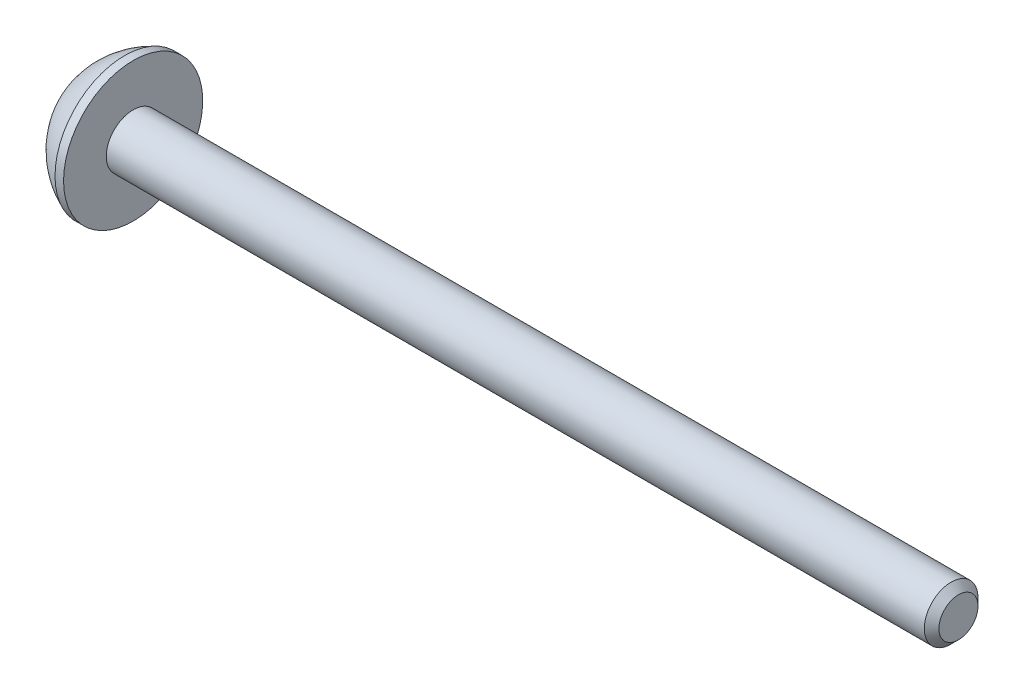
ISO-10303-21;
HEADER;
FILE_DESCRIPTION(('STEP AP214'),'2;1');
FILE_NAME('part.step','',(''),(''),'','','');
FILE_SCHEMA(('AUTOMOTIVE_DESIGN { 1 0 10303 214 1 1 1 1 }'));
ENDSEC;
DATA;
#1=APPLICATION_CONTEXT('core data for automotive mechanical design processes');
#2=APPLICATION_PROTOCOL_DEFINITION('international standard','automotive_design',2000,#1);
#3=PRODUCT_CONTEXT('',#1,'mechanical');
#4=PRODUCT('Part','Part','',(#3));
#5=PRODUCT_RELATED_PRODUCT_CATEGORY('part','',(#4));
#6=PRODUCT_DEFINITION_FORMATION('','',#4);
#7=PRODUCT_DEFINITION_CONTEXT('part definition',#1,'design');
#8=PRODUCT_DEFINITION('design','',#6,#7);
#9=PRODUCT_DEFINITION_SHAPE('','',#8);
#10=(LENGTH_UNIT() NAMED_UNIT(*) SI_UNIT(.MILLI.,.METRE.));
#11=(NAMED_UNIT(*) PLANE_ANGLE_UNIT() SI_UNIT($,.RADIAN.));
#12=(NAMED_UNIT(*) SI_UNIT($,.STERADIAN.) SOLID_ANGLE_UNIT());
#13=UNCERTAINTY_MEASURE_WITH_UNIT(LENGTH_MEASURE(1.E-05),#10,'distance_accuracy_value','');
#14=(GEOMETRIC_REPRESENTATION_CONTEXT(3) GLOBAL_UNCERTAINTY_ASSIGNED_CONTEXT((#13)) GLOBAL_UNIT_ASSIGNED_CONTEXT((#10,
#11,#12)) REPRESENTATION_CONTEXT('',''));
#15=CARTESIAN_POINT('',(0.,0.,0.));
#16=DIRECTION('',(0.,0.,1.));
#17=DIRECTION('',(1.,0.,0.));
#18=AXIS2_PLACEMENT_3D('',#15,#16,#17);
#19=CARTESIAN_POINT('',(41.9060149118823,0.,0.));
#20=DIRECTION('',(1.,0.,0.));
#21=DIRECTION('',(0.,0.,-1.));
#22=AXIS2_PLACEMENT_3D('',#19,#20,#21);
#23=PLANE('',#22);
#24=CARTESIAN_POINT('',(41.9060149118823,0.,0.));
#25=DIRECTION('',(-1.,0.,0.));
#26=DIRECTION('',(0.,0.,1.));
#27=AXIS2_PLACEMENT_3D('',#24,#25,#26);
#28=CIRCLE('',#27,1.6);
#29=CARTESIAN_POINT('',(41.9060149118823,0.,1.6));
#30=VERTEX_POINT('',#29);
#31=EDGE_CURVE('E11',#30,#30,#28,.T.);
#32=ORIENTED_EDGE('',*,*,#31,.F.);
#33=EDGE_LOOP('',(#32));
#34=FACE_BOUND('',#33,.T.);
#35=ADVANCED_FACE('F41',(#34),#23,.T.);
#36=CARTESIAN_POINT('',(41.3060149118823,0.,0.));
#37=DIRECTION('',(-1.,0.,0.));
#38=DIRECTION('',(0.,0.,1.));
#39=AXIS2_PLACEMENT_3D('',#36,#37,#38);
#40=CONICAL_SURFACE('',#39,2.2,0.785398163397457);
#41=ORIENTED_EDGE('',*,*,#31,.T.);
#42=EDGE_LOOP('',(#41));
#43=FACE_BOUND('',#42,.T.);
#44=CARTESIAN_POINT('',(41.3060149118823,0.,0.));
#45=DIRECTION('',(-1.,0.,0.));
#46=DIRECTION('',(0.,0.,1.));
#47=AXIS2_PLACEMENT_3D('',#44,#45,#46);
#48=CIRCLE('',#47,2.2);
#49=CARTESIAN_POINT('',(41.3060149118823,0.,2.2));
#50=VERTEX_POINT('',#49);
#51=EDGE_CURVE('E49',#50,#50,#48,.T.);
#52=ORIENTED_EDGE('',*,*,#51,.F.);
#53=EDGE_LOOP('',(#52));
#54=FACE_BOUND('',#53,.T.);
#55=ADVANCED_FACE('F186',(#43,#54),#40,.T.);
#56=CARTESIAN_POINT('',(-25.6939850881177,0.,0.));
#57=DIRECTION('',(-1.,0.,0.));
#58=DIRECTION('',(0.,0.,1.));
#59=AXIS2_PLACEMENT_3D('',#56,#57,#58);
#60=CYLINDRICAL_SURFACE('',#59,2.2);
#61=ORIENTED_EDGE('',*,*,#51,.T.);
#62=EDGE_LOOP('',(#61));
#63=FACE_BOUND('',#62,.T.);
#64=CARTESIAN_POINT('',(-25.6939850881177,0.,0.));
#65=DIRECTION('',(-1.,0.,0.));
#66=DIRECTION('',(0.,0.,1.));
#67=AXIS2_PLACEMENT_3D('',#64,#65,#66);
#68=CIRCLE('',#67,2.2);
#69=CARTESIAN_POINT('',(-25.6939850881177,0.,2.2));
#70=VERTEX_POINT('',#69);
#71=EDGE_CURVE('E176',#70,#70,#68,.T.);
#72=ORIENTED_EDGE('',*,*,#71,.F.);
#73=EDGE_LOOP('',(#72));
#74=FACE_BOUND('',#73,.T.);
#75=ADVANCED_FACE('F183',(#63,#74),#60,.T.);
#76=CARTESIAN_POINT('',(-25.6939850881177,0.,0.));
#77=DIRECTION('',(1.,0.,0.));
#78=DIRECTION('',(0.,0.,-1.));
#79=AXIS2_PLACEMENT_3D('',#76,#77,#78);
#80=PLANE('',#79);
#81=ORIENTED_EDGE('',*,*,#71,.T.);
#82=EDGE_LOOP('',(#81));
#83=FACE_BOUND('',#82,.T.);
#84=CARTESIAN_POINT('',(-25.6939850881177,0.,0.));
#85=DIRECTION('',(-1.,0.,0.));
#86=DIRECTION('',(0.,0.,1.));
#87=AXIS2_PLACEMENT_3D('',#84,#85,#86);
#88=CIRCLE('',#87,5.7);
#89=CARTESIAN_POINT('',(-25.6939850881177,0.,5.7));
#90=VERTEX_POINT('',#89);
#91=EDGE_CURVE('E172',#90,#90,#88,.T.);
#92=ORIENTED_EDGE('',*,*,#91,.F.);
#93=EDGE_LOOP('',(#92));
#94=FACE_BOUND('',#93,.T.);
#95=ADVANCED_FACE('F193',(#83,#94),#80,.T.);
#96=CARTESIAN_POINT('',(-25.6939850881177,0.,0.));
#97=DIRECTION('',(-1.,0.,0.));
#98=DIRECTION('',(0.,0.,1.));
#99=AXIS2_PLACEMENT_3D('',#96,#97,#98);
#100=CYLINDRICAL_SURFACE('',#99,5.7);
#101=CARTESIAN_POINT('',(-26.3939850881177,0.,0.));
#102=DIRECTION('',(-1.,0.,0.));
#103=DIRECTION('',(0.,0.,1.));
#104=AXIS2_PLACEMENT_3D('',#101,#102,#103);
#105=CIRCLE('',#104,5.7);
#106=CARTESIAN_POINT('',(-26.3939850881177,0.,5.7));
#107=VERTEX_POINT('',#106);
#108=EDGE_CURVE('E168',#107,#107,#105,.T.);
#109=ORIENTED_EDGE('',*,*,#108,.F.);
#110=EDGE_LOOP('',(#109));
#111=FACE_BOUND('',#110,.T.);
#112=ORIENTED_EDGE('',*,*,#91,.T.);
#113=EDGE_LOOP('',(#112));
#114=FACE_BOUND('',#113,.T.);
#115=ADVANCED_FACE('F199',(#111,#114),#100,.T.);
#116=CARTESIAN_POINT('',(-23.8656629789848,0.,0.));
#117=DIRECTION('',(-1.,0.,0.));
#118=DIRECTION('',(0.,0.,1.));
#119=AXIS2_PLACEMENT_3D('',#116,#117,#118);
#120=DEGENERATE_TOROIDAL_SURFACE('',#119,0.504642400047728,6.7,.F.);
#121=CARTESIAN_POINT('',(-29.6939850881177,0.,0.));
#122=DIRECTION('',(-1.,0.,0.));
#123=DIRECTION('',(0.,0.,1.));
#124=AXIS2_PLACEMENT_3D('',#121,#122,#123);
#125=CIRCLE('',#124,2.8);
#126=CARTESIAN_POINT('',(-29.6939850881177,0.,2.8));
#127=VERTEX_POINT('',#126);
#128=EDGE_CURVE('E155',#127,#127,#125,.T.);
#129=ORIENTED_EDGE('',*,*,#128,.F.);
#130=EDGE_LOOP('',(#129));
#131=FACE_BOUND('',#130,.T.);
#132=ORIENTED_EDGE('',*,*,#108,.T.);
#133=EDGE_LOOP('',(#132));
#134=FACE_BOUND('',#133,.T.);
#135=ADVANCED_FACE('F203',(#131,#134),#120,.F.);
#136=CARTESIAN_POINT('',(-29.6939850881177,0.,0.));
#137=DIRECTION('',(1.,0.,0.));
#138=DIRECTION('',(0.,0.,-1.));
#139=AXIS2_PLACEMENT_3D('',#136,#137,#138);
#140=PLANE('',#139);
#141=DIRECTION('',(0.,-0.5,-0.866025403784439));
#142=VECTOR('',#141,1.);
#143=CARTESIAN_POINT('',(-29.6939850881177,2.3094010767585,0.));
#144=LINE('',#143,#142);
#145=CARTESIAN_POINT('',(-29.6939850881177,2.3094010767585,0.));
#146=VERTEX_POINT('',#145);
#147=CARTESIAN_POINT('',(-29.6939850881177,1.15470053837925,-2.));
#148=VERTEX_POINT('',#147);
#149=EDGE_CURVE('E136',#146,#148,#144,.T.);
#150=ORIENTED_EDGE('',*,*,#149,.F.);
#151=DIRECTION('',(0.,0.5,-0.866025403784439));
#152=VECTOR('',#151,1.);
#153=CARTESIAN_POINT('',(-29.6939850881177,1.15470053837925,2.));
#154=LINE('',#153,#152);
#155=CARTESIAN_POINT('',(-29.6939850881177,1.15470053837925,2.));
#156=VERTEX_POINT('',#155);
#157=EDGE_CURVE('E56',#156,#146,#154,.T.);
#158=ORIENTED_EDGE('',*,*,#157,.F.);
#159=DIRECTION('',(0.,1.,0.));
#160=VECTOR('',#159,1.);
#161=CARTESIAN_POINT('',(-29.6939850881177,-1.15470053837925,2.));
#162=LINE('',#161,#160);
#163=CARTESIAN_POINT('',(-29.6939850881177,-1.15470053837925,2.));
#164=VERTEX_POINT('',#163);
#165=EDGE_CURVE('E149',#164,#156,#162,.T.);
#166=ORIENTED_EDGE('',*,*,#165,.F.);
#167=DIRECTION('',(0.,0.5,0.866025403784439));
#168=VECTOR('',#167,1.);
#169=CARTESIAN_POINT('',(-29.6939850881177,-2.3094010767585,0.));
#170=LINE('',#169,#168);
#171=CARTESIAN_POINT('',(-29.6939850881177,-2.3094010767585,0.));
#172=VERTEX_POINT('',#171);
#173=EDGE_CURVE('E146',#172,#164,#170,.T.);
#174=ORIENTED_EDGE('',*,*,#173,.F.);
#175=DIRECTION('',(0.,-0.5,0.866025403784439));
#176=VECTOR('',#175,1.);
#177=CARTESIAN_POINT('',(-29.6939850881177,-1.15470053837925,-2.));
#178=LINE('',#177,#176);
#179=CARTESIAN_POINT('',(-29.6939850881177,-1.15470053837925,-2.));
#180=VERTEX_POINT('',#179);
#181=EDGE_CURVE('E104',#180,#172,#178,.T.);
#182=ORIENTED_EDGE('',*,*,#181,.F.);
#183=DIRECTION('',(0.,-1.,0.));
#184=VECTOR('',#183,1.);
#185=CARTESIAN_POINT('',(-29.6939850881177,1.15470053837925,-2.));
#186=LINE('',#185,#184);
#187=EDGE_CURVE('E140',#148,#180,#186,.T.);
#188=ORIENTED_EDGE('',*,*,#187,.F.);
#189=EDGE_LOOP('',(#150,#158,#166,#174,#182,#188));
#190=FACE_BOUND('',#189,.T.);
#191=ORIENTED_EDGE('',*,*,#128,.T.);
#192=EDGE_LOOP('',(#191));
#193=FACE_BOUND('',#192,.T.);
#194=ADVANCED_FACE('F207',(#190,#193),#140,.F.);
#195=CARTESIAN_POINT('',(-27.6939850881177,1.15470053837925,2.));
#196=DIRECTION('',(0.,0.866025403784439,0.5));
#197=DIRECTION('',(0.,-0.5,0.866025403784439));
#198=AXIS2_PLACEMENT_3D('',#195,#196,#197);
#199=PLANE('',#198);
#200=ORIENTED_EDGE('',*,*,#157,.T.);
#201=DIRECTION('',(-1.,0.,0.));
#202=VECTOR('',#201,1.);
#203=CARTESIAN_POINT('',(-27.6939850881177,2.3094010767585,0.));
#204=LINE('',#203,#202);
#205=CARTESIAN_POINT('',(-27.6939850881177,2.3094010767585,0.));
#206=VERTEX_POINT('',#205);
#207=EDGE_CURVE('E86',#206,#146,#204,.T.);
#208=ORIENTED_EDGE('',*,*,#207,.F.);
#209=DIRECTION('',(0.,0.5,-0.866025403784439));
#210=VECTOR('',#209,1.);
#211=CARTESIAN_POINT('',(-27.6939850881177,1.15470053837925,2.));
#212=LINE('',#211,#210);
#213=CARTESIAN_POINT('',(-27.6939850881177,1.15470053837925,2.));
#214=VERTEX_POINT('',#213);
#215=EDGE_CURVE('E152',#214,#206,#212,.T.);
#216=ORIENTED_EDGE('',*,*,#215,.F.);
#217=DIRECTION('',(-1.,0.,0.));
#218=VECTOR('',#217,1.);
#219=CARTESIAN_POINT('',(-27.6939850881177,1.15470053837925,2.));
#220=LINE('',#219,#218);
#221=EDGE_CURVE('E64',#214,#156,#220,.T.);
#222=ORIENTED_EDGE('',*,*,#221,.T.);
#223=EDGE_LOOP('',(#200,#208,#216,#222));
#224=FACE_BOUND('',#223,.T.);
#225=ADVANCED_FACE('F211',(#224),#199,.F.);
#226=CARTESIAN_POINT('',(-27.6939850881177,-1.15470053837925,2.));
#227=DIRECTION('',(0.,0.,1.));
#228=DIRECTION('',(1.,0.,0.));
#229=AXIS2_PLACEMENT_3D('',#226,#227,#228);
#230=PLANE('',#229);
#231=ORIENTED_EDGE('',*,*,#165,.T.);
#232=ORIENTED_EDGE('',*,*,#221,.F.);
#233=DIRECTION('',(0.,1.,0.));
#234=VECTOR('',#233,1.);
#235=CARTESIAN_POINT('',(-27.6939850881177,-1.15470053837925,2.));
#236=LINE('',#235,#234);
#237=CARTESIAN_POINT('',(-27.6939850881177,-1.15470053837925,2.));
#238=VERTEX_POINT('',#237);
#239=EDGE_CURVE('E118',#238,#214,#236,.T.);
#240=ORIENTED_EDGE('',*,*,#239,.F.);
#241=DIRECTION('',(-1.,0.,0.));
#242=VECTOR('',#241,1.);
#243=CARTESIAN_POINT('',(-27.6939850881177,-1.15470053837925,2.));
#244=LINE('',#243,#242);
#245=EDGE_CURVE('E109',#238,#164,#244,.T.);
#246=ORIENTED_EDGE('',*,*,#245,.T.);
#247=EDGE_LOOP('',(#231,#232,#240,#246));
#248=FACE_BOUND('',#247,.T.);
#249=ADVANCED_FACE('F215',(#248),#230,.F.);
#250=CARTESIAN_POINT('',(-27.6939850881177,-2.3094010767585,0.));
#251=DIRECTION('',(0.,-0.866025403784439,0.5));
#252=DIRECTION('',(0.,-0.5,-0.866025403784439));
#253=AXIS2_PLACEMENT_3D('',#250,#251,#252);
#254=PLANE('',#253);
#255=ORIENTED_EDGE('',*,*,#173,.T.);
#256=ORIENTED_EDGE('',*,*,#245,.F.);
#257=DIRECTION('',(0.,0.5,0.866025403784439));
#258=VECTOR('',#257,1.);
#259=CARTESIAN_POINT('',(-27.6939850881177,-2.3094010767585,0.));
#260=LINE('',#259,#258);
#261=CARTESIAN_POINT('',(-27.6939850881177,-2.3094010767585,0.));
#262=VERTEX_POINT('',#261);
#263=EDGE_CURVE('E113',#262,#238,#260,.T.);
#264=ORIENTED_EDGE('',*,*,#263,.F.);
#265=DIRECTION('',(-1.,0.,0.));
#266=VECTOR('',#265,1.);
#267=CARTESIAN_POINT('',(-27.6939850881177,-2.3094010767585,0.));
#268=LINE('',#267,#266);
#269=EDGE_CURVE('E97',#262,#172,#268,.T.);
#270=ORIENTED_EDGE('',*,*,#269,.T.);
#271=EDGE_LOOP('',(#255,#256,#264,#270));
#272=FACE_BOUND('',#271,.T.);
#273=ADVANCED_FACE('F114',(#272),#254,.F.);
#274=CARTESIAN_POINT('',(-27.6939850881177,-1.15470053837925,-2.));
#275=DIRECTION('',(0.,-0.866025403784439,-0.5));
#276=DIRECTION('',(0.,0.5,-0.866025403784439));
#277=AXIS2_PLACEMENT_3D('',#274,#275,#276);
#278=PLANE('',#277);
#279=ORIENTED_EDGE('',*,*,#181,.T.);
#280=ORIENTED_EDGE('',*,*,#269,.F.);
#281=DIRECTION('',(0.,-0.5,0.866025403784439));
#282=VECTOR('',#281,1.);
#283=CARTESIAN_POINT('',(-27.6939850881177,-1.15470053837925,-2.));
#284=LINE('',#283,#282);
#285=CARTESIAN_POINT('',(-27.6939850881177,-1.15470053837925,-2.));
#286=VERTEX_POINT('',#285);
#287=EDGE_CURVE('E101',#286,#262,#284,.T.);
#288=ORIENTED_EDGE('',*,*,#287,.F.);
#289=DIRECTION('',(-1.,0.,0.));
#290=VECTOR('',#289,1.);
#291=CARTESIAN_POINT('',(-27.6939850881177,-1.15470053837925,-2.));
#292=LINE('',#291,#290);
#293=EDGE_CURVE('E110',#286,#180,#292,.T.);
#294=ORIENTED_EDGE('',*,*,#293,.T.);
#295=EDGE_LOOP('',(#279,#280,#288,#294));
#296=FACE_BOUND('',#295,.T.);
#297=ADVANCED_FACE('F99',(#296),#278,.F.);
#298=CARTESIAN_POINT('',(-27.6939850881177,1.15470053837925,-2.));
#299=DIRECTION('',(0.,0.,-1.));
#300=DIRECTION('',(0.,1.,0.));
#301=AXIS2_PLACEMENT_3D('',#298,#299,#300);
#302=PLANE('',#301);
#303=ORIENTED_EDGE('',*,*,#187,.T.);
#304=ORIENTED_EDGE('',*,*,#293,.F.);
#305=DIRECTION('',(0.,-1.,0.));
#306=VECTOR('',#305,1.);
#307=CARTESIAN_POINT('',(-27.6939850881177,1.15470053837925,-2.));
#308=LINE('',#307,#306);
#309=CARTESIAN_POINT('',(-27.6939850881177,1.15470053837925,-2.));
#310=VERTEX_POINT('',#309);
#311=EDGE_CURVE('E124',#310,#286,#308,.T.);
#312=ORIENTED_EDGE('',*,*,#311,.F.);
#313=DIRECTION('',(-1.,0.,0.));
#314=VECTOR('',#313,1.);
#315=CARTESIAN_POINT('',(-27.6939850881177,1.15470053837925,-2.));
#316=LINE('',#315,#314);
#317=EDGE_CURVE('E160',#310,#148,#316,.T.);
#318=ORIENTED_EDGE('',*,*,#317,.T.);
#319=EDGE_LOOP('',(#303,#304,#312,#318));
#320=FACE_BOUND('',#319,.T.);
#321=ADVANCED_FACE('F219',(#320),#302,.F.);
#322=CARTESIAN_POINT('',(-27.6939850881177,2.3094010767585,0.));
#323=DIRECTION('',(0.,0.866025403784439,-0.5));
#324=DIRECTION('',(0.,0.5,0.866025403784439));
#325=AXIS2_PLACEMENT_3D('',#322,#323,#324);
#326=PLANE('',#325);
#327=ORIENTED_EDGE('',*,*,#149,.T.);
#328=ORIENTED_EDGE('',*,*,#317,.F.);
#329=DIRECTION('',(0.,-0.5,-0.866025403784439));
#330=VECTOR('',#329,1.);
#331=CARTESIAN_POINT('',(-27.6939850881177,2.3094010767585,0.));
#332=LINE('',#331,#330);
#333=EDGE_CURVE('E128',#206,#310,#332,.T.);
#334=ORIENTED_EDGE('',*,*,#333,.F.);
#335=ORIENTED_EDGE('',*,*,#207,.T.);
#336=EDGE_LOOP('',(#327,#328,#334,#335));
#337=FACE_BOUND('',#336,.T.);
#338=ADVANCED_FACE('F216',(#337),#326,.F.);
#339=CARTESIAN_POINT('',(-27.6939850881177,0.,0.));
#340=DIRECTION('',(-1.,0.,0.));
#341=DIRECTION('',(0.,0.,1.));
#342=AXIS2_PLACEMENT_3D('',#339,#340,#341);
#343=PLANE('',#342);
#344=ORIENTED_EDGE('',*,*,#215,.T.);
#345=ORIENTED_EDGE('',*,*,#333,.T.);
#346=ORIENTED_EDGE('',*,*,#311,.T.);
#347=ORIENTED_EDGE('',*,*,#287,.T.);
#348=ORIENTED_EDGE('',*,*,#263,.T.);
#349=ORIENTED_EDGE('',*,*,#239,.T.);
#350=EDGE_LOOP('',(#344,#345,#346,#347,#348,#349));
#351=FACE_BOUND('',#350,.T.);
#352=ADVANCED_FACE('F121',(#351),#343,.T.);
#353=CLOSED_SHELL('',(#35,#55,#75,#95,#115,#135,#194,#225,#249,#273,#297,#321,#338,#352));
#354=MANIFOLD_SOLID_BREP('B2',#353);
#355=ADVANCED_BREP_SHAPE_REPRESENTATION('',(#18,#354),#14);
#356=SHAPE_DEFINITION_REPRESENTATION(#9,#355);
ENDSEC;
END-ISO-10303-21;
